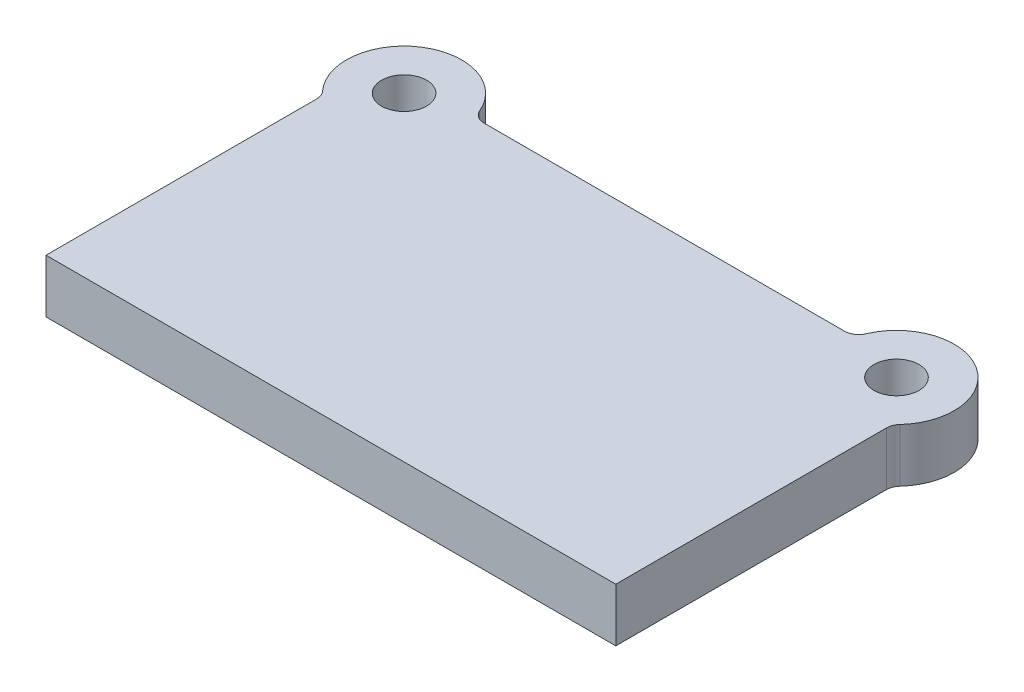
ISO-10303-21;
HEADER;
FILE_DESCRIPTION(('STEP AP214'),'2;1');
FILE_NAME('part.step','',(''),(''),'','','');
FILE_SCHEMA(('AUTOMOTIVE_DESIGN { 1 0 10303 214 1 1 1 1 }'));
ENDSEC;
DATA;
#1=APPLICATION_CONTEXT('core data for automotive mechanical design processes');
#2=APPLICATION_PROTOCOL_DEFINITION('international standard','automotive_design',2000,#1);
#3=PRODUCT_CONTEXT('',#1,'mechanical');
#4=PRODUCT('Part','Part','',(#3));
#5=PRODUCT_RELATED_PRODUCT_CATEGORY('part','',(#4));
#6=PRODUCT_DEFINITION_FORMATION('','',#4);
#7=PRODUCT_DEFINITION_CONTEXT('part definition',#1,'design');
#8=PRODUCT_DEFINITION('design','',#6,#7);
#9=PRODUCT_DEFINITION_SHAPE('','',#8);
#10=(LENGTH_UNIT() NAMED_UNIT(*) SI_UNIT(.MILLI.,.METRE.));
#11=(NAMED_UNIT(*) PLANE_ANGLE_UNIT() SI_UNIT($,.RADIAN.));
#12=(NAMED_UNIT(*) SI_UNIT($,.STERADIAN.) SOLID_ANGLE_UNIT());
#13=UNCERTAINTY_MEASURE_WITH_UNIT(LENGTH_MEASURE(1.E-05),#10,'distance_accuracy_value','');
#14=(GEOMETRIC_REPRESENTATION_CONTEXT(3) GLOBAL_UNCERTAINTY_ASSIGNED_CONTEXT((#13)) GLOBAL_UNIT_ASSIGNED_CONTEXT((#10,
#11,#12)) REPRESENTATION_CONTEXT('',''));
#15=CARTESIAN_POINT('',(0.,0.,0.));
#16=DIRECTION('',(0.,0.,1.));
#17=DIRECTION('',(1.,0.,0.));
#18=AXIS2_PLACEMENT_3D('',#15,#16,#17);
#19=CARTESIAN_POINT('',(-175.,38.,-227.));
#20=DIRECTION('',(0.,1.,0.));
#21=DIRECTION('',(0.,0.,1.));
#22=AXIS2_PLACEMENT_3D('',#19,#20,#21);
#23=PLANE('',#22);
#24=CARTESIAN_POINT('',(-175.,38.,-227.));
#25=DIRECTION('',(0.,1.,0.));
#26=DIRECTION('',(0.,0.,1.));
#27=AXIS2_PLACEMENT_3D('',#24,#25,#26);
#28=CIRCLE('',#27,16.);
#29=CARTESIAN_POINT('',(-175.,38.,-211.));
#30=VERTEX_POINT('',#29);
#31=EDGE_CURVE('E209',#30,#30,#28,.T.);
#32=ORIENTED_EDGE('',*,*,#31,.F.);
#33=EDGE_LOOP('',(#32));
#34=FACE_BOUND('',#33,.T.);
#35=CARTESIAN_POINT('',(-175.,38.,-227.));
#36=DIRECTION('',(0.,1.,0.));
#37=DIRECTION('',(0.,0.,1.));
#38=AXIS2_PLACEMENT_3D('',#35,#36,#37);
#39=CIRCLE('',#38,41.);
#40=CARTESIAN_POINT('',(-137.284167189385,38.,-243.078431372549));
#41=VERTEX_POINT('',#40);
#42=CARTESIAN_POINT('',(-205.147058823529,38.,-199.212325676828));
#43=VERTEX_POINT('',#42);
#44=EDGE_CURVE('E139',#41,#43,#39,.T.);
#45=ORIENTED_EDGE('',*,*,#44,.T.);
#46=CARTESIAN_POINT('',(-212.5,38.,-192.434844134591));
#47=DIRECTION('',(0.,1.,0.));
#48=DIRECTION('',(0.,0.,1.));
#49=AXIS2_PLACEMENT_3D('',#46,#47,#48);
#50=CIRCLE('',#49,10.);
#51=CARTESIAN_POINT('',(-202.5,38.,-192.434844134591));
#52=VERTEX_POINT('',#51);
#53=EDGE_CURVE('E116',#43,#52,#50,.F.);
#54=ORIENTED_EDGE('',*,*,#53,.T.);
#55=DIRECTION('',(0.,0.,1.));
#56=VECTOR('',#55,1.);
#57=CARTESIAN_POINT('',(-202.5,38.,0.));
#58=LINE('',#57,#56);
#59=CARTESIAN_POINT('',(-202.5,38.,0.));
#60=VERTEX_POINT('',#59);
#61=EDGE_CURVE('E109',#52,#60,#58,.T.);
#62=ORIENTED_EDGE('',*,*,#61,.T.);
#63=DIRECTION('',(1.,0.,0.));
#64=VECTOR('',#63,1.);
#65=CARTESIAN_POINT('',(202.5,38.,0.));
#66=LINE('',#65,#64);
#67=CARTESIAN_POINT('',(202.5,38.,0.));
#68=VERTEX_POINT('',#67);
#69=EDGE_CURVE('E113',#60,#68,#66,.T.);
#70=ORIENTED_EDGE('',*,*,#69,.T.);
#71=DIRECTION('',(0.,0.,-1.));
#72=VECTOR('',#71,1.);
#73=CARTESIAN_POINT('',(202.5,38.,0.));
#74=LINE('',#73,#72);
#75=CARTESIAN_POINT('',(202.5,38.,-192.434844134591));
#76=VERTEX_POINT('',#75);
#77=EDGE_CURVE('E129',#68,#76,#74,.T.);
#78=ORIENTED_EDGE('',*,*,#77,.T.);
#79=CARTESIAN_POINT('',(212.5,38.,-192.434844134591));
#80=DIRECTION('',(0.,1.,0.));
#81=DIRECTION('',(0.,0.,1.));
#82=AXIS2_PLACEMENT_3D('',#79,#80,#81);
#83=CIRCLE('',#82,10.);
#84=CARTESIAN_POINT('',(205.147058823529,38.,-199.212325676828));
#85=VERTEX_POINT('',#84);
#86=EDGE_CURVE('E11',#76,#85,#83,.F.);
#87=ORIENTED_EDGE('',*,*,#86,.T.);
#88=CARTESIAN_POINT('',(175.,38.,-227.));
#89=DIRECTION('',(0.,1.,0.));
#90=DIRECTION('',(0.,0.,-1.));
#91=AXIS2_PLACEMENT_3D('',#88,#89,#90);
#92=CIRCLE('',#91,41.);
#93=CARTESIAN_POINT('',(137.284167189385,38.,-243.078431372549));
#94=VERTEX_POINT('',#93);
#95=EDGE_CURVE('E175',#85,#94,#92,.T.);
#96=ORIENTED_EDGE('',*,*,#95,.T.);
#97=CARTESIAN_POINT('',(128.08518357704,38.,-247.));
#98=DIRECTION('',(0.,1.,0.));
#99=DIRECTION('',(0.,0.,1.));
#100=AXIS2_PLACEMENT_3D('',#97,#98,#99);
#101=CIRCLE('',#100,10.);
#102=CARTESIAN_POINT('',(128.08518357704,38.,-237.));
#103=VERTEX_POINT('',#102);
#104=EDGE_CURVE('E167',#94,#103,#101,.F.);
#105=ORIENTED_EDGE('',*,*,#104,.T.);
#106=DIRECTION('',(-1.,0.,0.));
#107=VECTOR('',#106,1.);
#108=CARTESIAN_POINT('',(135.238209295858,38.,-237.));
#109=LINE('',#108,#107);
#110=CARTESIAN_POINT('',(-128.08518357704,38.,-237.));
#111=VERTEX_POINT('',#110);
#112=EDGE_CURVE('E172',#103,#111,#109,.T.);
#113=ORIENTED_EDGE('',*,*,#112,.T.);
#114=CARTESIAN_POINT('',(-128.08518357704,38.,-247.));
#115=DIRECTION('',(0.,1.,0.));
#116=DIRECTION('',(0.,0.,1.));
#117=AXIS2_PLACEMENT_3D('',#114,#115,#116);
#118=CIRCLE('',#117,10.);
#119=EDGE_CURVE('E163',#111,#41,#118,.F.);
#120=ORIENTED_EDGE('',*,*,#119,.T.);
#121=EDGE_LOOP('',(#45,#54,#62,#70,#78,#87,#96,#105,#113,#120));
#122=FACE_BOUND('',#121,.T.);
#123=CARTESIAN_POINT('',(175.,38.,-227.));
#124=DIRECTION('',(0.,1.,0.));
#125=DIRECTION('',(0.,0.,-1.));
#126=AXIS2_PLACEMENT_3D('',#123,#124,#125);
#127=CIRCLE('',#126,16.);
#128=CARTESIAN_POINT('',(175.,38.,-243.));
#129=VERTEX_POINT('',#128);
#130=EDGE_CURVE('E219',#129,#129,#127,.T.);
#131=ORIENTED_EDGE('',*,*,#130,.F.);
#132=EDGE_LOOP('',(#131));
#133=FACE_BOUND('',#132,.T.);
#134=ADVANCED_FACE('F33',(#34,#122,#133),#23,.T.);
#135=CARTESIAN_POINT('',(-175.,0.,-227.));
#136=DIRECTION('',(0.,1.,0.));
#137=DIRECTION('',(0.,0.,1.));
#138=AXIS2_PLACEMENT_3D('',#135,#136,#137);
#139=PLANE('',#138);
#140=DIRECTION('',(0.,0.,1.));
#141=VECTOR('',#140,1.);
#142=CARTESIAN_POINT('',(-202.5,0.,0.));
#143=LINE('',#142,#141);
#144=CARTESIAN_POINT('',(-202.5,0.,-192.434844134591));
#145=VERTEX_POINT('',#144);
#146=CARTESIAN_POINT('',(-202.5,0.,0.));
#147=VERTEX_POINT('',#146);
#148=EDGE_CURVE('E133',#145,#147,#143,.T.);
#149=ORIENTED_EDGE('',*,*,#148,.F.);
#150=CARTESIAN_POINT('',(-212.5,0.,-192.434844134591));
#151=DIRECTION('',(0.,1.,0.));
#152=DIRECTION('',(0.,0.,1.));
#153=AXIS2_PLACEMENT_3D('',#150,#151,#152);
#154=CIRCLE('',#153,10.);
#155=CARTESIAN_POINT('',(-205.147058823529,0.,-199.212325676828));
#156=VERTEX_POINT('',#155);
#157=EDGE_CURVE('E158',#145,#156,#154,.T.);
#158=ORIENTED_EDGE('',*,*,#157,.T.);
#159=CARTESIAN_POINT('',(-175.,0.,-227.));
#160=DIRECTION('',(0.,1.,0.));
#161=DIRECTION('',(0.,0.,1.));
#162=AXIS2_PLACEMENT_3D('',#159,#160,#161);
#163=CIRCLE('',#162,41.);
#164=CARTESIAN_POINT('',(-137.284167189385,0.,-243.078431372549));
#165=VERTEX_POINT('',#164);
#166=EDGE_CURVE('E121',#165,#156,#163,.T.);
#167=ORIENTED_EDGE('',*,*,#166,.F.);
#168=CARTESIAN_POINT('',(-128.08518357704,0.,-247.));
#169=DIRECTION('',(0.,1.,0.));
#170=DIRECTION('',(0.,0.,1.));
#171=AXIS2_PLACEMENT_3D('',#168,#169,#170);
#172=CIRCLE('',#171,10.);
#173=CARTESIAN_POINT('',(-128.08518357704,0.,-237.));
#174=VERTEX_POINT('',#173);
#175=EDGE_CURVE('E161',#165,#174,#172,.T.);
#176=ORIENTED_EDGE('',*,*,#175,.T.);
#177=DIRECTION('',(-1.,0.,0.));
#178=VECTOR('',#177,1.);
#179=CARTESIAN_POINT('',(135.238209295858,0.,-237.));
#180=LINE('',#179,#178);
#181=CARTESIAN_POINT('',(128.08518357704,0.,-237.));
#182=VERTEX_POINT('',#181);
#183=EDGE_CURVE('E190',#182,#174,#180,.T.);
#184=ORIENTED_EDGE('',*,*,#183,.F.);
#185=CARTESIAN_POINT('',(128.08518357704,0.,-247.));
#186=DIRECTION('',(0.,1.,0.));
#187=DIRECTION('',(0.,0.,1.));
#188=AXIS2_PLACEMENT_3D('',#185,#186,#187);
#189=CIRCLE('',#188,10.);
#190=CARTESIAN_POINT('',(137.284167189385,0.,-243.078431372549));
#191=VERTEX_POINT('',#190);
#192=EDGE_CURVE('E165',#182,#191,#189,.T.);
#193=ORIENTED_EDGE('',*,*,#192,.T.);
#194=CARTESIAN_POINT('',(175.,0.,-227.));
#195=DIRECTION('',(0.,1.,0.));
#196=DIRECTION('',(0.,0.,-1.));
#197=AXIS2_PLACEMENT_3D('',#194,#195,#196);
#198=CIRCLE('',#197,41.);
#199=CARTESIAN_POINT('',(205.147058823529,0.,-199.212325676828));
#200=VERTEX_POINT('',#199);
#201=EDGE_CURVE('E189',#200,#191,#198,.T.);
#202=ORIENTED_EDGE('',*,*,#201,.F.);
#203=CARTESIAN_POINT('',(212.5,0.,-192.434844134591));
#204=DIRECTION('',(0.,1.,0.));
#205=DIRECTION('',(0.,0.,1.));
#206=AXIS2_PLACEMENT_3D('',#203,#204,#205);
#207=CIRCLE('',#206,10.);
#208=CARTESIAN_POINT('',(202.5,0.,-192.434844134591));
#209=VERTEX_POINT('',#208);
#210=EDGE_CURVE('E41',#200,#209,#207,.T.);
#211=ORIENTED_EDGE('',*,*,#210,.T.);
#212=DIRECTION('',(0.,0.,-1.));
#213=VECTOR('',#212,1.);
#214=CARTESIAN_POINT('',(202.5,0.,0.));
#215=LINE('',#214,#213);
#216=CARTESIAN_POINT('',(202.5,0.,0.));
#217=VERTEX_POINT('',#216);
#218=EDGE_CURVE('E194',#217,#209,#215,.T.);
#219=ORIENTED_EDGE('',*,*,#218,.F.);
#220=DIRECTION('',(1.,0.,0.));
#221=VECTOR('',#220,1.);
#222=CARTESIAN_POINT('',(202.5,0.,0.));
#223=LINE('',#222,#221);
#224=EDGE_CURVE('E197',#147,#217,#223,.T.);
#225=ORIENTED_EDGE('',*,*,#224,.F.);
#226=EDGE_LOOP('',(#149,#158,#167,#176,#184,#193,#202,#211,#219,#225));
#227=FACE_BOUND('',#226,.T.);
#228=CARTESIAN_POINT('',(-175.,0.,-227.));
#229=DIRECTION('',(0.,1.,0.));
#230=DIRECTION('',(0.,0.,1.));
#231=AXIS2_PLACEMENT_3D('',#228,#229,#230);
#232=CIRCLE('',#231,16.);
#233=CARTESIAN_POINT('',(-175.,0.,-211.));
#234=VERTEX_POINT('',#233);
#235=EDGE_CURVE('E212',#234,#234,#232,.T.);
#236=ORIENTED_EDGE('',*,*,#235,.T.);
#237=EDGE_LOOP('',(#236));
#238=FACE_BOUND('',#237,.T.);
#239=CARTESIAN_POINT('',(175.,0.,-227.));
#240=DIRECTION('',(0.,1.,0.));
#241=DIRECTION('',(0.,0.,-1.));
#242=AXIS2_PLACEMENT_3D('',#239,#240,#241);
#243=CIRCLE('',#242,16.);
#244=CARTESIAN_POINT('',(175.,0.,-243.));
#245=VERTEX_POINT('',#244);
#246=EDGE_CURVE('E221',#245,#245,#243,.T.);
#247=ORIENTED_EDGE('',*,*,#246,.T.);
#248=EDGE_LOOP('',(#247));
#249=FACE_BOUND('',#248,.T.);
#250=ADVANCED_FACE('F187',(#227,#238,#249),#139,.F.);
#251=CARTESIAN_POINT('',(-202.5,38.,0.));
#252=DIRECTION('',(1.,0.,0.));
#253=DIRECTION('',(0.,0.,-1.));
#254=AXIS2_PLACEMENT_3D('',#251,#252,#253);
#255=PLANE('',#254);
#256=ORIENTED_EDGE('',*,*,#61,.F.);
#257=DIRECTION('',(0.,1.,0.));
#258=VECTOR('',#257,1.);
#259=CARTESIAN_POINT('',(-202.5,0.,-192.434844134591));
#260=LINE('',#259,#258);
#261=EDGE_CURVE('E135',#52,#145,#260,.F.);
#262=ORIENTED_EDGE('',*,*,#261,.T.);
#263=ORIENTED_EDGE('',*,*,#148,.T.);
#264=DIRECTION('',(0.,-1.,0.));
#265=VECTOR('',#264,1.);
#266=CARTESIAN_POINT('',(-202.5,38.,0.));
#267=LINE('',#266,#265);
#268=EDGE_CURVE('E126',#60,#147,#267,.T.);
#269=ORIENTED_EDGE('',*,*,#268,.F.);
#270=EDGE_LOOP('',(#256,#262,#263,#269));
#271=FACE_BOUND('',#270,.T.);
#272=ADVANCED_FACE('F131',(#271),#255,.F.);
#273=CARTESIAN_POINT('',(202.5,38.,0.));
#274=DIRECTION('',(0.,0.,-1.));
#275=DIRECTION('',(-1.,0.,0.));
#276=AXIS2_PLACEMENT_3D('',#273,#274,#275);
#277=PLANE('',#276);
#278=ORIENTED_EDGE('',*,*,#224,.T.);
#279=DIRECTION('',(0.,-1.,0.));
#280=VECTOR('',#279,1.);
#281=CARTESIAN_POINT('',(202.5,38.,0.));
#282=LINE('',#281,#280);
#283=EDGE_CURVE('E128',#68,#217,#282,.T.);
#284=ORIENTED_EDGE('',*,*,#283,.F.);
#285=ORIENTED_EDGE('',*,*,#69,.F.);
#286=ORIENTED_EDGE('',*,*,#268,.T.);
#287=EDGE_LOOP('',(#278,#284,#285,#286));
#288=FACE_BOUND('',#287,.T.);
#289=ADVANCED_FACE('F125',(#288),#277,.F.);
#290=CARTESIAN_POINT('',(202.5,38.,0.));
#291=DIRECTION('',(-1.,0.,0.));
#292=DIRECTION('',(0.,0.,1.));
#293=AXIS2_PLACEMENT_3D('',#290,#291,#292);
#294=PLANE('',#293);
#295=ORIENTED_EDGE('',*,*,#218,.T.);
#296=DIRECTION('',(0.,1.,0.));
#297=VECTOR('',#296,1.);
#298=CARTESIAN_POINT('',(202.5,38.,-192.434844134591));
#299=LINE('',#298,#297);
#300=EDGE_CURVE('E48',#209,#76,#299,.T.);
#301=ORIENTED_EDGE('',*,*,#300,.T.);
#302=ORIENTED_EDGE('',*,*,#77,.F.);
#303=ORIENTED_EDGE('',*,*,#283,.T.);
#304=EDGE_LOOP('',(#295,#301,#302,#303));
#305=FACE_BOUND('',#304,.T.);
#306=ADVANCED_FACE('F247',(#305),#294,.F.);
#307=CARTESIAN_POINT('',(175.,38.,-227.));
#308=DIRECTION('',(0.,-1.,0.));
#309=DIRECTION('',(0.,0.,-1.));
#310=AXIS2_PLACEMENT_3D('',#307,#308,#309);
#311=CYLINDRICAL_SURFACE('',#310,41.);
#312=ORIENTED_EDGE('',*,*,#201,.T.);
#313=DIRECTION('',(0.,-1.,0.));
#314=VECTOR('',#313,1.);
#315=CARTESIAN_POINT('',(137.284167189385,38.,-243.078431372549));
#316=LINE('',#315,#314);
#317=EDGE_CURVE('E155',#191,#94,#316,.F.);
#318=ORIENTED_EDGE('',*,*,#317,.T.);
#319=ORIENTED_EDGE('',*,*,#95,.F.);
#320=DIRECTION('',(0.,-1.,0.));
#321=VECTOR('',#320,1.);
#322=CARTESIAN_POINT('',(205.147058823529,38.,-199.212325676828));
#323=LINE('',#322,#321);
#324=EDGE_CURVE('E152',#85,#200,#323,.T.);
#325=ORIENTED_EDGE('',*,*,#324,.T.);
#326=EDGE_LOOP('',(#312,#318,#319,#325));
#327=FACE_BOUND('',#326,.T.);
#328=ADVANCED_FACE('F192',(#327),#311,.T.);
#329=CARTESIAN_POINT('',(135.238209295858,38.,-237.));
#330=DIRECTION('',(0.,0.,1.));
#331=DIRECTION('',(1.,0.,0.));
#332=AXIS2_PLACEMENT_3D('',#329,#330,#331);
#333=PLANE('',#332);
#334=ORIENTED_EDGE('',*,*,#183,.T.);
#335=DIRECTION('',(0.,1.,0.));
#336=VECTOR('',#335,1.);
#337=CARTESIAN_POINT('',(-128.08518357704,38.,-237.));
#338=LINE('',#337,#336);
#339=EDGE_CURVE('E150',#174,#111,#338,.T.);
#340=ORIENTED_EDGE('',*,*,#339,.T.);
#341=ORIENTED_EDGE('',*,*,#112,.F.);
#342=DIRECTION('',(0.,1.,0.));
#343=VECTOR('',#342,1.);
#344=CARTESIAN_POINT('',(128.08518357704,0.,-237.));
#345=LINE('',#344,#343);
#346=EDGE_CURVE('E147',#103,#182,#345,.F.);
#347=ORIENTED_EDGE('',*,*,#346,.T.);
#348=EDGE_LOOP('',(#334,#340,#341,#347));
#349=FACE_BOUND('',#348,.T.);
#350=ADVANCED_FACE('F181',(#349),#333,.F.);
#351=CARTESIAN_POINT('',(-175.,38.,-227.));
#352=DIRECTION('',(0.,-1.,0.));
#353=DIRECTION('',(0.,0.,-1.));
#354=AXIS2_PLACEMENT_3D('',#351,#352,#353);
#355=CYLINDRICAL_SURFACE('',#354,41.);
#356=ORIENTED_EDGE('',*,*,#166,.T.);
#357=DIRECTION('',(0.,-1.,0.));
#358=VECTOR('',#357,1.);
#359=CARTESIAN_POINT('',(-205.147058823529,38.,-199.212325676828));
#360=LINE('',#359,#358);
#361=EDGE_CURVE('E145',#156,#43,#360,.F.);
#362=ORIENTED_EDGE('',*,*,#361,.T.);
#363=ORIENTED_EDGE('',*,*,#44,.F.);
#364=DIRECTION('',(0.,-1.,0.));
#365=VECTOR('',#364,1.);
#366=CARTESIAN_POINT('',(-137.284167189385,38.,-243.078431372549));
#367=LINE('',#366,#365);
#368=EDGE_CURVE('E137',#41,#165,#367,.T.);
#369=ORIENTED_EDGE('',*,*,#368,.T.);
#370=EDGE_LOOP('',(#356,#362,#363,#369));
#371=FACE_BOUND('',#370,.T.);
#372=ADVANCED_FACE('F204',(#371),#355,.T.);
#373=CARTESIAN_POINT('',(-175.,38.,-227.));
#374=DIRECTION('',(0.,-1.,0.));
#375=DIRECTION('',(0.,0.,-1.));
#376=AXIS2_PLACEMENT_3D('',#373,#374,#375);
#377=CYLINDRICAL_SURFACE('',#376,16.);
#378=ORIENTED_EDGE('',*,*,#31,.T.);
#379=EDGE_LOOP('',(#378));
#380=FACE_BOUND('',#379,.T.);
#381=ORIENTED_EDGE('',*,*,#235,.F.);
#382=EDGE_LOOP('',(#381));
#383=FACE_BOUND('',#382,.T.);
#384=ADVANCED_FACE('F238',(#380,#383),#377,.F.);
#385=CARTESIAN_POINT('',(175.,38.,-227.));
#386=DIRECTION('',(0.,-1.,0.));
#387=DIRECTION('',(0.,0.,-1.));
#388=AXIS2_PLACEMENT_3D('',#385,#386,#387);
#389=CYLINDRICAL_SURFACE('',#388,16.);
#390=ORIENTED_EDGE('',*,*,#130,.T.);
#391=EDGE_LOOP('',(#390));
#392=FACE_BOUND('',#391,.T.);
#393=ORIENTED_EDGE('',*,*,#246,.F.);
#394=EDGE_LOOP('',(#393));
#395=FACE_BOUND('',#394,.T.);
#396=ADVANCED_FACE('F227',(#392,#395),#389,.F.);
#397=CARTESIAN_POINT('',(-212.5,38.,-192.434844134591));
#398=DIRECTION('',(0.,-1.,0.));
#399=DIRECTION('',(0.,0.,-1.));
#400=AXIS2_PLACEMENT_3D('',#397,#398,#399);
#401=CYLINDRICAL_SURFACE('',#400,10.);
#402=ORIENTED_EDGE('',*,*,#53,.F.);
#403=ORIENTED_EDGE('',*,*,#361,.F.);
#404=ORIENTED_EDGE('',*,*,#157,.F.);
#405=ORIENTED_EDGE('',*,*,#261,.F.);
#406=EDGE_LOOP('',(#402,#403,#404,#405));
#407=FACE_BOUND('',#406,.T.);
#408=ADVANCED_FACE('F208',(#407),#401,.F.);
#409=CARTESIAN_POINT('',(-128.08518357704,38.,-247.));
#410=DIRECTION('',(0.,-1.,0.));
#411=DIRECTION('',(0.,0.,-1.));
#412=AXIS2_PLACEMENT_3D('',#409,#410,#411);
#413=CYLINDRICAL_SURFACE('',#412,10.);
#414=ORIENTED_EDGE('',*,*,#119,.F.);
#415=ORIENTED_EDGE('',*,*,#339,.F.);
#416=ORIENTED_EDGE('',*,*,#175,.F.);
#417=ORIENTED_EDGE('',*,*,#368,.F.);
#418=EDGE_LOOP('',(#414,#415,#416,#417));
#419=FACE_BOUND('',#418,.T.);
#420=ADVANCED_FACE('F256',(#419),#413,.F.);
#421=CARTESIAN_POINT('',(128.08518357704,38.,-247.));
#422=DIRECTION('',(0.,-1.,0.));
#423=DIRECTION('',(0.,0.,-1.));
#424=AXIS2_PLACEMENT_3D('',#421,#422,#423);
#425=CYLINDRICAL_SURFACE('',#424,10.);
#426=ORIENTED_EDGE('',*,*,#104,.F.);
#427=ORIENTED_EDGE('',*,*,#317,.F.);
#428=ORIENTED_EDGE('',*,*,#192,.F.);
#429=ORIENTED_EDGE('',*,*,#346,.F.);
#430=EDGE_LOOP('',(#426,#427,#428,#429));
#431=FACE_BOUND('',#430,.T.);
#432=ADVANCED_FACE('F185',(#431),#425,.F.);
#433=CARTESIAN_POINT('',(212.5,38.,-192.434844134591));
#434=DIRECTION('',(0.,-1.,0.));
#435=DIRECTION('',(0.,0.,-1.));
#436=AXIS2_PLACEMENT_3D('',#433,#434,#435);
#437=CYLINDRICAL_SURFACE('',#436,10.);
#438=ORIENTED_EDGE('',*,*,#86,.F.);
#439=ORIENTED_EDGE('',*,*,#300,.F.);
#440=ORIENTED_EDGE('',*,*,#210,.F.);
#441=ORIENTED_EDGE('',*,*,#324,.F.);
#442=EDGE_LOOP('',(#438,#439,#440,#441));
#443=FACE_BOUND('',#442,.T.);
#444=ADVANCED_FACE('F35',(#443),#437,.F.);
#445=CLOSED_SHELL('',(#134,#250,#272,#289,#306,#328,#350,#372,#384,#396,#408,#420,#432,#444));
#446=MANIFOLD_SOLID_BREP('B2',#445);
#447=ADVANCED_BREP_SHAPE_REPRESENTATION('',(#18,#446),#14);
#448=SHAPE_DEFINITION_REPRESENTATION(#9,#447);
ENDSEC;
END-ISO-10303-21;
